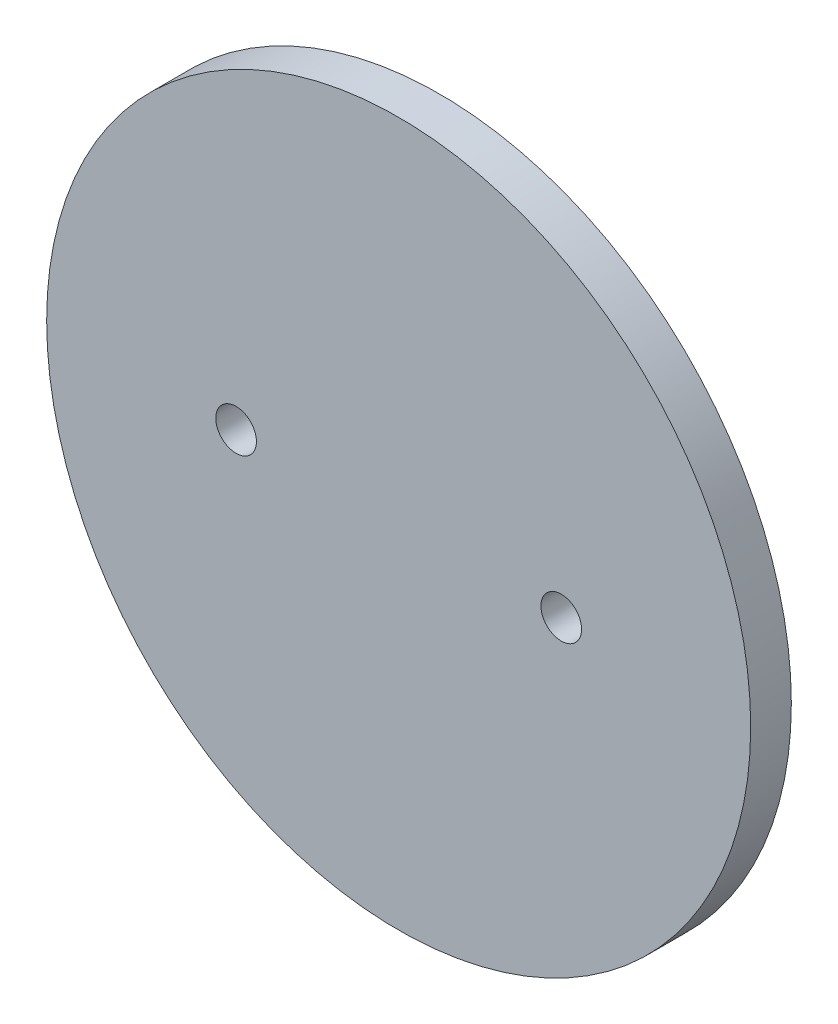
ISO-10303-21;
HEADER;
FILE_DESCRIPTION(('STEP AP214'),'2;1');
FILE_NAME('part.step','',(''),(''),'','','');
FILE_SCHEMA(('AUTOMOTIVE_DESIGN { 1 0 10303 214 1 1 1 1 }'));
ENDSEC;
DATA;
#1=APPLICATION_CONTEXT('core data for automotive mechanical design processes');
#2=APPLICATION_PROTOCOL_DEFINITION('international standard','automotive_design',2000,#1);
#3=PRODUCT_CONTEXT('',#1,'mechanical');
#4=PRODUCT('Part','Part','',(#3));
#5=PRODUCT_RELATED_PRODUCT_CATEGORY('part','',(#4));
#6=PRODUCT_DEFINITION_FORMATION('','',#4);
#7=PRODUCT_DEFINITION_CONTEXT('part definition',#1,'design');
#8=PRODUCT_DEFINITION('design','',#6,#7);
#9=PRODUCT_DEFINITION_SHAPE('','',#8);
#10=(LENGTH_UNIT() NAMED_UNIT(*) SI_UNIT(.MILLI.,.METRE.));
#11=(NAMED_UNIT(*) PLANE_ANGLE_UNIT() SI_UNIT($,.RADIAN.));
#12=(NAMED_UNIT(*) SI_UNIT($,.STERADIAN.) SOLID_ANGLE_UNIT());
#13=UNCERTAINTY_MEASURE_WITH_UNIT(LENGTH_MEASURE(1.E-05),#10,'distance_accuracy_value','');
#14=(GEOMETRIC_REPRESENTATION_CONTEXT(3) GLOBAL_UNCERTAINTY_ASSIGNED_CONTEXT((#13)) GLOBAL_UNIT_ASSIGNED_CONTEXT((#10,
#11,#12)) REPRESENTATION_CONTEXT('',''));
#15=CARTESIAN_POINT('',(0.,0.,0.));
#16=DIRECTION('',(0.,0.,1.));
#17=DIRECTION('',(1.,0.,0.));
#18=AXIS2_PLACEMENT_3D('',#15,#16,#17);
#19=CARTESIAN_POINT('',(0.,0.,2.54));
#20=DIRECTION('',(0.,0.,-1.));
#21=DIRECTION('',(-1.,0.,0.));
#22=AXIS2_PLACEMENT_3D('',#19,#20,#21);
#23=CYLINDRICAL_SURFACE('',#22,22.);
#24=CARTESIAN_POINT('',(0.,0.,2.54));
#25=DIRECTION('',(0.,0.,1.));
#26=DIRECTION('',(1.,0.,0.));
#27=AXIS2_PLACEMENT_3D('',#24,#25,#26);
#28=CIRCLE('',#27,22.);
#29=CARTESIAN_POINT('',(22.,0.,2.54));
#30=VERTEX_POINT('',#29);
#31=EDGE_CURVE('E10',#30,#30,#28,.T.);
#32=ORIENTED_EDGE('',*,*,#31,.F.);
#33=EDGE_LOOP('',(#32));
#34=FACE_BOUND('',#33,.T.);
#35=CARTESIAN_POINT('',(0.,0.,0.));
#36=DIRECTION('',(0.,0.,1.));
#37=DIRECTION('',(1.,0.,0.));
#38=AXIS2_PLACEMENT_3D('',#35,#36,#37);
#39=CIRCLE('',#38,22.);
#40=CARTESIAN_POINT('',(22.,0.,0.));
#41=VERTEX_POINT('',#40);
#42=EDGE_CURVE('E34',#41,#41,#39,.T.);
#43=ORIENTED_EDGE('',*,*,#42,.T.);
#44=EDGE_LOOP('',(#43));
#45=FACE_BOUND('',#44,.T.);
#46=ADVANCED_FACE('F31',(#34,#45),#23,.T.);
#47=CARTESIAN_POINT('',(0.,0.,2.54));
#48=DIRECTION('',(0.,0.,1.));
#49=DIRECTION('',(1.,0.,0.));
#50=AXIS2_PLACEMENT_3D('',#47,#48,#49);
#51=PLANE('',#50);
#52=CARTESIAN_POINT('',(-10.16,0.,2.54));
#53=DIRECTION('',(0.,0.,1.));
#54=DIRECTION('',(1.,0.,0.));
#55=AXIS2_PLACEMENT_3D('',#52,#53,#54);
#56=CIRCLE('',#55,1.27);
#57=CARTESIAN_POINT('',(-8.89,0.,2.54));
#58=VERTEX_POINT('',#57);
#59=EDGE_CURVE('E49',#58,#58,#56,.T.);
#60=ORIENTED_EDGE('',*,*,#59,.F.);
#61=EDGE_LOOP('',(#60));
#62=FACE_BOUND('',#61,.T.);
#63=CARTESIAN_POINT('',(10.16,0.,2.54));
#64=DIRECTION('',(0.,0.,1.));
#65=DIRECTION('',(1.,0.,0.));
#66=AXIS2_PLACEMENT_3D('',#63,#64,#65);
#67=CIRCLE('',#66,1.27);
#68=CARTESIAN_POINT('',(11.43,0.,2.54));
#69=VERTEX_POINT('',#68);
#70=EDGE_CURVE('E43',#69,#69,#67,.T.);
#71=ORIENTED_EDGE('',*,*,#70,.F.);
#72=EDGE_LOOP('',(#71));
#73=FACE_BOUND('',#72,.T.);
#74=ORIENTED_EDGE('',*,*,#31,.T.);
#75=EDGE_LOOP('',(#74));
#76=FACE_BOUND('',#75,.T.);
#77=ADVANCED_FACE('F65',(#62,#73,#76),#51,.T.);
#78=CARTESIAN_POINT('',(0.,0.,0.));
#79=DIRECTION('',(0.,0.,1.));
#80=DIRECTION('',(1.,0.,0.));
#81=AXIS2_PLACEMENT_3D('',#78,#79,#80);
#82=PLANE('',#81);
#83=CARTESIAN_POINT('',(-10.16,0.,0.));
#84=DIRECTION('',(0.,0.,1.));
#85=DIRECTION('',(1.,0.,0.));
#86=AXIS2_PLACEMENT_3D('',#83,#84,#85);
#87=CIRCLE('',#86,1.27);
#88=CARTESIAN_POINT('',(-8.89,0.,0.));
#89=VERTEX_POINT('',#88);
#90=EDGE_CURVE('E41',#89,#89,#87,.T.);
#91=ORIENTED_EDGE('',*,*,#90,.T.);
#92=EDGE_LOOP('',(#91));
#93=FACE_BOUND('',#92,.T.);
#94=CARTESIAN_POINT('',(10.16,0.,0.));
#95=DIRECTION('',(0.,0.,1.));
#96=DIRECTION('',(1.,0.,0.));
#97=AXIS2_PLACEMENT_3D('',#94,#95,#96);
#98=CIRCLE('',#97,1.27);
#99=CARTESIAN_POINT('',(11.43,0.,0.));
#100=VERTEX_POINT('',#99);
#101=EDGE_CURVE('E46',#100,#100,#98,.T.);
#102=ORIENTED_EDGE('',*,*,#101,.T.);
#103=EDGE_LOOP('',(#102));
#104=FACE_BOUND('',#103,.T.);
#105=ORIENTED_EDGE('',*,*,#42,.F.);
#106=EDGE_LOOP('',(#105));
#107=FACE_BOUND('',#106,.T.);
#108=ADVANCED_FACE('F55',(#93,#104,#107),#82,.F.);
#109=CARTESIAN_POINT('',(10.16,0.,0.));
#110=DIRECTION('',(0.,0.,1.));
#111=DIRECTION('',(1.,0.,0.));
#112=AXIS2_PLACEMENT_3D('',#109,#110,#111);
#113=CYLINDRICAL_SURFACE('',#112,1.27);
#114=ORIENTED_EDGE('',*,*,#101,.F.);
#115=EDGE_LOOP('',(#114));
#116=FACE_BOUND('',#115,.T.);
#117=ORIENTED_EDGE('',*,*,#70,.T.);
#118=EDGE_LOOP('',(#117));
#119=FACE_BOUND('',#118,.T.);
#120=ADVANCED_FACE('F61',(#116,#119),#113,.F.);
#121=CARTESIAN_POINT('',(-10.16,0.,0.));
#122=DIRECTION('',(0.,0.,1.));
#123=DIRECTION('',(1.,0.,0.));
#124=AXIS2_PLACEMENT_3D('',#121,#122,#123);
#125=CYLINDRICAL_SURFACE('',#124,1.27);
#126=ORIENTED_EDGE('',*,*,#90,.F.);
#127=EDGE_LOOP('',(#126));
#128=FACE_BOUND('',#127,.T.);
#129=ORIENTED_EDGE('',*,*,#59,.T.);
#130=EDGE_LOOP('',(#129));
#131=FACE_BOUND('',#130,.T.);
#132=ADVANCED_FACE('F58',(#128,#131),#125,.F.);
#133=CLOSED_SHELL('',(#46,#77,#108,#120,#132));
#134=MANIFOLD_SOLID_BREP('B2',#133);
#135=ADVANCED_BREP_SHAPE_REPRESENTATION('',(#18,#134),#14);
#136=SHAPE_DEFINITION_REPRESENTATION(#9,#135);
ENDSEC;
END-ISO-10303-21;
